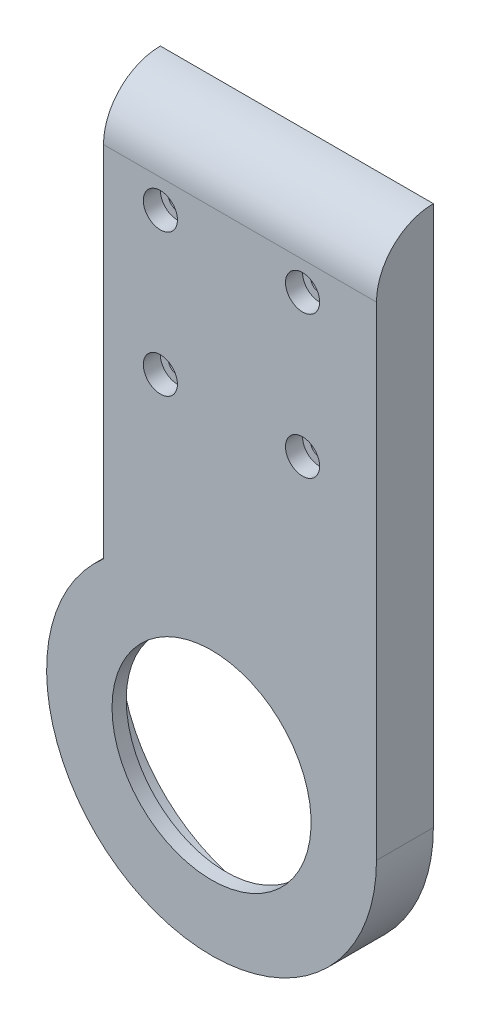
ISO-10303-21;
HEADER;
FILE_DESCRIPTION(('STEP AP214'),'2;1');
FILE_NAME('part.step','',(''),(''),'','','');
FILE_SCHEMA(('AUTOMOTIVE_DESIGN { 1 0 10303 214 1 1 1 1 }'));
ENDSEC;
DATA;
#1=APPLICATION_CONTEXT('core data for automotive mechanical design processes');
#2=APPLICATION_PROTOCOL_DEFINITION('international standard','automotive_design',2000,#1);
#3=PRODUCT_CONTEXT('',#1,'mechanical');
#4=PRODUCT('Part','Part','',(#3));
#5=PRODUCT_RELATED_PRODUCT_CATEGORY('part','',(#4));
#6=PRODUCT_DEFINITION_FORMATION('','',#4);
#7=PRODUCT_DEFINITION_CONTEXT('part definition',#1,'design');
#8=PRODUCT_DEFINITION('design','',#6,#7);
#9=PRODUCT_DEFINITION_SHAPE('','',#8);
#10=(LENGTH_UNIT() NAMED_UNIT(*) SI_UNIT(.MILLI.,.METRE.));
#11=(NAMED_UNIT(*) PLANE_ANGLE_UNIT() SI_UNIT($,.RADIAN.));
#12=(NAMED_UNIT(*) SI_UNIT($,.STERADIAN.) SOLID_ANGLE_UNIT());
#13=UNCERTAINTY_MEASURE_WITH_UNIT(LENGTH_MEASURE(1.E-05),#10,'distance_accuracy_value','');
#14=(GEOMETRIC_REPRESENTATION_CONTEXT(3) GLOBAL_UNCERTAINTY_ASSIGNED_CONTEXT((#13)) GLOBAL_UNIT_ASSIGNED_CONTEXT((#10,
#11,#12)) REPRESENTATION_CONTEXT('',''));
#15=CARTESIAN_POINT('',(0.,0.,0.));
#16=DIRECTION('',(0.,0.,1.));
#17=DIRECTION('',(1.,0.,0.));
#18=AXIS2_PLACEMENT_3D('',#15,#16,#17);
#19=CARTESIAN_POINT('',(-9.,80.,0.));
#20=DIRECTION('',(0.,0.,1.));
#21=DIRECTION('',(1.,0.,0.));
#22=AXIS2_PLACEMENT_3D('',#19,#20,#21);
#23=CYLINDRICAL_SURFACE('',#22,1.60000000000001);
#24=CARTESIAN_POINT('',(-9.,80.,0.));
#25=DIRECTION('',(0.,0.,1.));
#26=DIRECTION('',(1.,0.,0.));
#27=AXIS2_PLACEMENT_3D('',#24,#25,#26);
#28=CIRCLE('',#27,1.60000000000001);
#29=CARTESIAN_POINT('',(-7.39999999999999,80.,0.));
#30=VERTEX_POINT('',#29);
#31=EDGE_CURVE('E142',#30,#30,#28,.T.);
#32=ORIENTED_EDGE('',*,*,#31,.F.);
#33=EDGE_LOOP('',(#32));
#34=FACE_BOUND('',#33,.T.);
#35=CARTESIAN_POINT('',(-9.,80.,7.));
#36=DIRECTION('',(0.,0.,1.));
#37=DIRECTION('',(1.,0.,0.));
#38=AXIS2_PLACEMENT_3D('',#35,#36,#37);
#39=CIRCLE('',#38,1.60000000000001);
#40=CARTESIAN_POINT('',(-7.39999999999999,80.,7.));
#41=VERTEX_POINT('',#40);
#42=EDGE_CURVE('E45',#41,#41,#39,.F.);
#43=ORIENTED_EDGE('',*,*,#42,.F.);
#44=EDGE_LOOP('',(#43));
#45=FACE_BOUND('',#44,.T.);
#46=ADVANCED_FACE('F41',(#34,#45),#23,.F.);
#47=CARTESIAN_POINT('',(16.,80.,0.));
#48=DIRECTION('',(0.,0.,1.));
#49=DIRECTION('',(1.,0.,0.));
#50=AXIS2_PLACEMENT_3D('',#47,#48,#49);
#51=CYLINDRICAL_SURFACE('',#50,1.60000000000001);
#52=CARTESIAN_POINT('',(16.,80.,0.));
#53=DIRECTION('',(0.,0.,1.));
#54=DIRECTION('',(1.,0.,0.));
#55=AXIS2_PLACEMENT_3D('',#52,#53,#54);
#56=CIRCLE('',#55,1.60000000000001);
#57=CARTESIAN_POINT('',(17.6,80.,0.));
#58=VERTEX_POINT('',#57);
#59=EDGE_CURVE('E138',#58,#58,#56,.T.);
#60=ORIENTED_EDGE('',*,*,#59,.F.);
#61=EDGE_LOOP('',(#60));
#62=FACE_BOUND('',#61,.T.);
#63=CARTESIAN_POINT('',(16.,80.,7.));
#64=DIRECTION('',(0.,0.,1.));
#65=DIRECTION('',(1.,0.,0.));
#66=AXIS2_PLACEMENT_3D('',#63,#64,#65);
#67=CIRCLE('',#66,1.60000000000001);
#68=CARTESIAN_POINT('',(17.6,80.,7.));
#69=VERTEX_POINT('',#68);
#70=EDGE_CURVE('E124',#69,#69,#67,.F.);
#71=ORIENTED_EDGE('',*,*,#70,.F.);
#72=EDGE_LOOP('',(#71));
#73=FACE_BOUND('',#72,.T.);
#74=ADVANCED_FACE('F184',(#62,#73),#51,.F.);
#75=CARTESIAN_POINT('',(16.0000000000013,55.,0.));
#76=DIRECTION('',(0.,0.,1.));
#77=DIRECTION('',(1.,0.,0.));
#78=AXIS2_PLACEMENT_3D('',#75,#76,#77);
#79=CYLINDRICAL_SURFACE('',#78,1.6);
#80=CARTESIAN_POINT('',(16.0000000000013,55.,0.));
#81=DIRECTION('',(0.,0.,1.));
#82=DIRECTION('',(1.,0.,0.));
#83=AXIS2_PLACEMENT_3D('',#80,#81,#82);
#84=CIRCLE('',#83,1.6);
#85=CARTESIAN_POINT('',(17.6000000000013,55.,0.));
#86=VERTEX_POINT('',#85);
#87=EDGE_CURVE('E133',#86,#86,#84,.T.);
#88=ORIENTED_EDGE('',*,*,#87,.F.);
#89=EDGE_LOOP('',(#88));
#90=FACE_BOUND('',#89,.T.);
#91=CARTESIAN_POINT('',(16.0000000000013,55.,7.));
#92=DIRECTION('',(0.,0.,1.));
#93=DIRECTION('',(1.,0.,0.));
#94=AXIS2_PLACEMENT_3D('',#91,#92,#93);
#95=CIRCLE('',#94,1.6);
#96=CARTESIAN_POINT('',(17.6000000000013,55.,7.));
#97=VERTEX_POINT('',#96);
#98=EDGE_CURVE('E121',#97,#97,#95,.F.);
#99=ORIENTED_EDGE('',*,*,#98,.F.);
#100=EDGE_LOOP('',(#99));
#101=FACE_BOUND('',#100,.T.);
#102=ADVANCED_FACE('F190',(#90,#101),#79,.F.);
#103=CARTESIAN_POINT('',(-8.99999999999867,55.,0.));
#104=DIRECTION('',(0.,0.,1.));
#105=DIRECTION('',(1.,0.,0.));
#106=AXIS2_PLACEMENT_3D('',#103,#104,#105);
#107=CYLINDRICAL_SURFACE('',#106,1.59999999999999);
#108=CARTESIAN_POINT('',(-8.99999999999867,55.,0.));
#109=DIRECTION('',(0.,0.,1.));
#110=DIRECTION('',(1.,0.,0.));
#111=AXIS2_PLACEMENT_3D('',#108,#109,#110);
#112=CIRCLE('',#111,1.59999999999999);
#113=CARTESIAN_POINT('',(-7.39999999999868,55.,0.));
#114=VERTEX_POINT('',#113);
#115=EDGE_CURVE('E129',#114,#114,#112,.T.);
#116=ORIENTED_EDGE('',*,*,#115,.F.);
#117=EDGE_LOOP('',(#116));
#118=FACE_BOUND('',#117,.T.);
#119=CARTESIAN_POINT('',(-8.99999999999867,55.,7.));
#120=DIRECTION('',(0.,0.,1.));
#121=DIRECTION('',(1.,0.,0.));
#122=AXIS2_PLACEMENT_3D('',#119,#120,#121);
#123=CIRCLE('',#122,1.59999999999999);
#124=CARTESIAN_POINT('',(-7.39999999999868,55.,7.));
#125=VERTEX_POINT('',#124);
#126=EDGE_CURVE('E118',#125,#125,#123,.F.);
#127=ORIENTED_EDGE('',*,*,#126,.F.);
#128=EDGE_LOOP('',(#127));
#129=FACE_BOUND('',#128,.T.);
#130=ADVANCED_FACE('F196',(#118,#129),#107,.F.);
#131=CARTESIAN_POINT('',(0.,0.,7.5));
#132=DIRECTION('',(0.,0.,-1.));
#133=DIRECTION('',(-1.,0.,0.));
#134=AXIS2_PLACEMENT_3D('',#131,#132,#133);
#135=PLANE('',#134);
#136=CARTESIAN_POINT('',(0.,0.,7.5));
#137=DIRECTION('',(0.,0.,-1.));
#138=DIRECTION('',(-1.,0.,0.));
#139=AXIS2_PLACEMENT_3D('',#136,#137,#138);
#140=CIRCLE('',#139,17.5);
#141=CARTESIAN_POINT('',(-17.5,0.,7.5));
#142=VERTEX_POINT('',#141);
#143=EDGE_CURVE('E152',#142,#142,#140,.T.);
#144=ORIENTED_EDGE('',*,*,#143,.F.);
#145=EDGE_LOOP('',(#144));
#146=FACE_BOUND('',#145,.T.);
#147=CARTESIAN_POINT('',(0.,0.,7.5));
#148=DIRECTION('',(0.,0.,-1.));
#149=DIRECTION('',(-1.,0.,0.));
#150=AXIS2_PLACEMENT_3D('',#147,#148,#149);
#151=CIRCLE('',#150,24.);
#152=CARTESIAN_POINT('',(-24.,0.,7.5));
#153=VERTEX_POINT('',#152);
#154=EDGE_CURVE('E108',#153,#153,#151,.F.);
#155=ORIENTED_EDGE('',*,*,#154,.F.);
#156=EDGE_LOOP('',(#155));
#157=FACE_BOUND('',#156,.T.);
#158=ADVANCED_FACE('F215',(#146,#157),#135,.T.);
#159=CARTESIAN_POINT('',(0.,0.,10.));
#160=DIRECTION('',(0.,0.,1.));
#161=DIRECTION('',(1.,0.,0.));
#162=AXIS2_PLACEMENT_3D('',#159,#160,#161);
#163=PLANE('',#162);
#164=CARTESIAN_POINT('',(-8.99999999999867,55.,10.));
#165=DIRECTION('',(0.,0.,1.));
#166=DIRECTION('',(1.,0.,0.));
#167=AXIS2_PLACEMENT_3D('',#164,#165,#166);
#168=CIRCLE('',#167,3.);
#169=CARTESIAN_POINT('',(-5.99999999999867,55.,10.));
#170=VERTEX_POINT('',#169);
#171=EDGE_CURVE('E250',#170,#170,#168,.T.);
#172=ORIENTED_EDGE('',*,*,#171,.F.);
#173=EDGE_LOOP('',(#172));
#174=FACE_BOUND('',#173,.T.);
#175=CARTESIAN_POINT('',(16.0000000000013,55.,10.));
#176=DIRECTION('',(0.,0.,1.));
#177=DIRECTION('',(1.,0.,0.));
#178=AXIS2_PLACEMENT_3D('',#175,#176,#177);
#179=CIRCLE('',#178,3.);
#180=CARTESIAN_POINT('',(19.0000000000013,55.,10.));
#181=VERTEX_POINT('',#180);
#182=EDGE_CURVE('E256',#181,#181,#179,.T.);
#183=ORIENTED_EDGE('',*,*,#182,.F.);
#184=EDGE_LOOP('',(#183));
#185=FACE_BOUND('',#184,.T.);
#186=CARTESIAN_POINT('',(16.,80.,10.));
#187=DIRECTION('',(0.,0.,1.));
#188=DIRECTION('',(1.,0.,0.));
#189=AXIS2_PLACEMENT_3D('',#186,#187,#188);
#190=CIRCLE('',#189,3.);
#191=CARTESIAN_POINT('',(19.,80.,10.));
#192=VERTEX_POINT('',#191);
#193=EDGE_CURVE('E244',#192,#192,#190,.T.);
#194=ORIENTED_EDGE('',*,*,#193,.F.);
#195=EDGE_LOOP('',(#194));
#196=FACE_BOUND('',#195,.T.);
#197=CARTESIAN_POINT('',(-9.,80.,10.));
#198=DIRECTION('',(0.,0.,1.));
#199=DIRECTION('',(1.,0.,0.));
#200=AXIS2_PLACEMENT_3D('',#197,#198,#199);
#201=CIRCLE('',#200,3.);
#202=CARTESIAN_POINT('',(-6.,80.,10.));
#203=VERTEX_POINT('',#202);
#204=EDGE_CURVE('E241',#203,#203,#201,.T.);
#205=ORIENTED_EDGE('',*,*,#204,.F.);
#206=EDGE_LOOP('',(#205));
#207=FACE_BOUND('',#206,.T.);
#208=CARTESIAN_POINT('',(0.,0.,10.));
#209=DIRECTION('',(0.,0.,-1.));
#210=DIRECTION('',(-1.,0.,0.));
#211=AXIS2_PLACEMENT_3D('',#208,#209,#210);
#212=CIRCLE('',#211,17.5);
#213=CARTESIAN_POINT('',(-17.5,0.,10.));
#214=VERTEX_POINT('',#213);
#215=EDGE_CURVE('E155',#214,#214,#212,.T.);
#216=ORIENTED_EDGE('',*,*,#215,.T.);
#217=EDGE_LOOP('',(#216));
#218=FACE_BOUND('',#217,.T.);
#219=DIRECTION('',(0.,-1.,0.));
#220=VECTOR('',#219,1.);
#221=CARTESIAN_POINT('',(29.,0.,10.));
#222=LINE('',#221,#220);
#223=CARTESIAN_POINT('',(29.,85.,10.));
#224=VERTEX_POINT('',#223);
#225=CARTESIAN_POINT('',(29.,0.,10.));
#226=VERTEX_POINT('',#225);
#227=EDGE_CURVE('E105',#224,#226,#222,.T.);
#228=ORIENTED_EDGE('',*,*,#227,.F.);
#229=DIRECTION('',(1.,0.,0.));
#230=VECTOR('',#229,1.);
#231=CARTESIAN_POINT('',(-19.,85.,10.));
#232=LINE('',#231,#230);
#233=CARTESIAN_POINT('',(-19.,85.,10.));
#234=VERTEX_POINT('',#233);
#235=EDGE_CURVE('E50',#224,#234,#232,.F.);
#236=ORIENTED_EDGE('',*,*,#235,.T.);
#237=DIRECTION('',(0.,1.,0.));
#238=VECTOR('',#237,1.);
#239=CARTESIAN_POINT('',(-19.,0.,10.));
#240=LINE('',#239,#238);
#241=CARTESIAN_POINT('',(-19.,21.9089023002066,10.));
#242=VERTEX_POINT('',#241);
#243=EDGE_CURVE('E102',#242,#234,#240,.T.);
#244=ORIENTED_EDGE('',*,*,#243,.F.);
#245=CARTESIAN_POINT('',(0.,0.,10.));
#246=DIRECTION('',(0.,0.,-1.));
#247=DIRECTION('',(-1.,0.,0.));
#248=AXIS2_PLACEMENT_3D('',#245,#246,#247);
#249=CIRCLE('',#248,29.);
#250=EDGE_CURVE('E94',#226,#242,#249,.T.);
#251=ORIENTED_EDGE('',*,*,#250,.F.);
#252=EDGE_LOOP('',(#228,#236,#244,#251));
#253=FACE_BOUND('',#252,.T.);
#254=ADVANCED_FACE('F225',(#174,#185,#196,#207,#218,#253),#163,.T.);
#255=CARTESIAN_POINT('',(0.,0.,0.));
#256=DIRECTION('',(0.,0.,1.));
#257=DIRECTION('',(1.,0.,0.));
#258=AXIS2_PLACEMENT_3D('',#255,#256,#257);
#259=PLANE('',#258);
#260=ORIENTED_EDGE('',*,*,#115,.T.);
#261=EDGE_LOOP('',(#260));
#262=FACE_BOUND('',#261,.T.);
#263=ORIENTED_EDGE('',*,*,#87,.T.);
#264=EDGE_LOOP('',(#263));
#265=FACE_BOUND('',#264,.T.);
#266=ORIENTED_EDGE('',*,*,#59,.T.);
#267=EDGE_LOOP('',(#266));
#268=FACE_BOUND('',#267,.T.);
#269=ORIENTED_EDGE('',*,*,#31,.T.);
#270=EDGE_LOOP('',(#269));
#271=FACE_BOUND('',#270,.T.);
#272=CARTESIAN_POINT('',(0.,0.,0.));
#273=DIRECTION('',(0.,0.,-1.));
#274=DIRECTION('',(-1.,0.,0.));
#275=AXIS2_PLACEMENT_3D('',#272,#273,#274);
#276=CIRCLE('',#275,26.1);
#277=CARTESIAN_POINT('',(-26.1,0.,0.));
#278=VERTEX_POINT('',#277);
#279=EDGE_CURVE('E158',#278,#278,#276,.T.);
#280=ORIENTED_EDGE('',*,*,#279,.F.);
#281=EDGE_LOOP('',(#280));
#282=FACE_BOUND('',#281,.T.);
#283=DIRECTION('',(0.,-1.,0.));
#284=VECTOR('',#283,1.);
#285=CARTESIAN_POINT('',(29.,0.,0.));
#286=LINE('',#285,#284);
#287=CARTESIAN_POINT('',(29.,95.,0.));
#288=VERTEX_POINT('',#287);
#289=CARTESIAN_POINT('',(29.,0.,0.));
#290=VERTEX_POINT('',#289);
#291=EDGE_CURVE('E98',#288,#290,#286,.T.);
#292=ORIENTED_EDGE('',*,*,#291,.T.);
#293=CARTESIAN_POINT('',(0.,0.,0.));
#294=DIRECTION('',(0.,0.,-1.));
#295=DIRECTION('',(-1.,0.,0.));
#296=AXIS2_PLACEMENT_3D('',#293,#294,#295);
#297=CIRCLE('',#296,29.);
#298=CARTESIAN_POINT('',(-19.,21.9089023002066,0.));
#299=VERTEX_POINT('',#298);
#300=EDGE_CURVE('E83',#290,#299,#297,.T.);
#301=ORIENTED_EDGE('',*,*,#300,.T.);
#302=DIRECTION('',(0.,1.,0.));
#303=VECTOR('',#302,1.);
#304=CARTESIAN_POINT('',(-19.,0.,0.));
#305=LINE('',#304,#303);
#306=CARTESIAN_POINT('',(-19.,95.,0.));
#307=VERTEX_POINT('',#306);
#308=EDGE_CURVE('E106',#299,#307,#305,.T.);
#309=ORIENTED_EDGE('',*,*,#308,.T.);
#310=DIRECTION('',(1.,0.,0.));
#311=VECTOR('',#310,1.);
#312=CARTESIAN_POINT('',(0.,95.,0.));
#313=LINE('',#312,#311);
#314=EDGE_CURVE('E101',#307,#288,#313,.T.);
#315=ORIENTED_EDGE('',*,*,#314,.T.);
#316=EDGE_LOOP('',(#292,#301,#309,#315));
#317=FACE_BOUND('',#316,.T.);
#318=ADVANCED_FACE('F99',(#262,#265,#268,#271,#282,#317),#259,.F.);
#319=CARTESIAN_POINT('',(29.,0.,0.));
#320=DIRECTION('',(-1.,0.,0.));
#321=DIRECTION('',(0.,-1.,0.));
#322=AXIS2_PLACEMENT_3D('',#319,#320,#321);
#323=PLANE('',#322);
#324=ORIENTED_EDGE('',*,*,#291,.F.);
#325=CARTESIAN_POINT('',(29.,85.,0.));
#326=DIRECTION('',(-1.,0.,0.));
#327=DIRECTION('',(0.,-1.,0.));
#328=AXIS2_PLACEMENT_3D('',#325,#326,#327);
#329=CIRCLE('',#328,10.);
#330=EDGE_CURVE('E65',#288,#224,#329,.F.);
#331=ORIENTED_EDGE('',*,*,#330,.T.);
#332=ORIENTED_EDGE('',*,*,#227,.T.);
#333=DIRECTION('',(0.,0.,1.));
#334=VECTOR('',#333,1.);
#335=CARTESIAN_POINT('',(29.,0.,0.));
#336=LINE('',#335,#334);
#337=EDGE_CURVE('E87',#290,#226,#336,.T.);
#338=ORIENTED_EDGE('',*,*,#337,.F.);
#339=EDGE_LOOP('',(#324,#331,#332,#338));
#340=FACE_BOUND('',#339,.T.);
#341=ADVANCED_FACE('F104',(#340),#323,.F.);
#342=CARTESIAN_POINT('',(-19.,0.,0.));
#343=DIRECTION('',(1.,0.,0.));
#344=DIRECTION('',(0.,0.,-1.));
#345=AXIS2_PLACEMENT_3D('',#342,#343,#344);
#346=PLANE('',#345);
#347=ORIENTED_EDGE('',*,*,#243,.T.);
#348=CARTESIAN_POINT('',(-19.,85.,0.));
#349=DIRECTION('',(1.,0.,0.));
#350=DIRECTION('',(0.,0.,-1.));
#351=AXIS2_PLACEMENT_3D('',#348,#349,#350);
#352=CIRCLE('',#351,10.);
#353=EDGE_CURVE('E11',#234,#307,#352,.F.);
#354=ORIENTED_EDGE('',*,*,#353,.T.);
#355=ORIENTED_EDGE('',*,*,#308,.F.);
#356=DIRECTION('',(0.,0.,-1.));
#357=VECTOR('',#356,1.);
#358=CARTESIAN_POINT('',(-19.,21.9089023002066,10.));
#359=LINE('',#358,#357);
#360=EDGE_CURVE('E90',#299,#242,#359,.F.);
#361=ORIENTED_EDGE('',*,*,#360,.T.);
#362=EDGE_LOOP('',(#347,#354,#355,#361));
#363=FACE_BOUND('',#362,.T.);
#364=ADVANCED_FACE('F168',(#363),#346,.F.);
#365=CARTESIAN_POINT('',(0.,0.,10.));
#366=DIRECTION('',(0.,0.,-1.));
#367=DIRECTION('',(-1.,0.,0.));
#368=AXIS2_PLACEMENT_3D('',#365,#366,#367);
#369=CYLINDRICAL_SURFACE('',#368,29.);
#370=ORIENTED_EDGE('',*,*,#337,.T.);
#371=ORIENTED_EDGE('',*,*,#250,.T.);
#372=ORIENTED_EDGE('',*,*,#360,.F.);
#373=ORIENTED_EDGE('',*,*,#300,.F.);
#374=EDGE_LOOP('',(#370,#371,#372,#373));
#375=FACE_BOUND('',#374,.T.);
#376=ADVANCED_FACE('F85',(#375),#369,.T.);
#377=CARTESIAN_POINT('',(0.,0.,7.5));
#378=DIRECTION('',(0.,0.,-1.));
#379=DIRECTION('',(-1.,0.,0.));
#380=AXIS2_PLACEMENT_3D('',#377,#378,#379);
#381=CYLINDRICAL_SURFACE('',#380,26.1);
#382=CARTESIAN_POINT('',(0.,0.,7.5));
#383=DIRECTION('',(0.,0.,-1.));
#384=DIRECTION('',(-1.,0.,0.));
#385=AXIS2_PLACEMENT_3D('',#382,#383,#384);
#386=CIRCLE('',#385,26.1);
#387=CARTESIAN_POINT('',(-26.1,0.,7.5));
#388=VERTEX_POINT('',#387);
#389=EDGE_CURVE('E95',#388,#388,#386,.T.);
#390=ORIENTED_EDGE('',*,*,#389,.F.);
#391=EDGE_LOOP('',(#390));
#392=FACE_BOUND('',#391,.T.);
#393=ORIENTED_EDGE('',*,*,#279,.T.);
#394=EDGE_LOOP('',(#393));
#395=FACE_BOUND('',#394,.T.);
#396=ADVANCED_FACE('F213',(#392,#395),#381,.F.);
#397=CARTESIAN_POINT('',(0.,0.,7.5));
#398=DIRECTION('',(0.,0.,-1.));
#399=DIRECTION('',(-1.,0.,0.));
#400=AXIS2_PLACEMENT_3D('',#397,#398,#399);
#401=CIRCLE('',#400,26.05);
#402=CARTESIAN_POINT('',(-26.05,0.,7.5));
#403=VERTEX_POINT('',#402);
#404=EDGE_CURVE('E148',#403,#403,#401,.T.);
#405=ORIENTED_EDGE('',*,*,#404,.F.);
#406=EDGE_LOOP('',(#405));
#407=FACE_BOUND('',#406,.T.);
#408=ORIENTED_EDGE('',*,*,#389,.T.);
#409=EDGE_LOOP('',(#408));
#410=FACE_BOUND('',#409,.T.);
#411=ADVANCED_FACE('F209',(#407,#410),#135,.T.);
#412=CARTESIAN_POINT('',(0.,0.,10.));
#413=DIRECTION('',(0.,0.,-1.));
#414=DIRECTION('',(-1.,0.,0.));
#415=AXIS2_PLACEMENT_3D('',#412,#413,#414);
#416=CYLINDRICAL_SURFACE('',#415,17.5);
#417=ORIENTED_EDGE('',*,*,#215,.F.);
#418=EDGE_LOOP('',(#417));
#419=FACE_BOUND('',#418,.T.);
#420=ORIENTED_EDGE('',*,*,#143,.T.);
#421=EDGE_LOOP('',(#420));
#422=FACE_BOUND('',#421,.T.);
#423=ADVANCED_FACE('F202',(#419,#422),#416,.F.);
#424=CARTESIAN_POINT('',(0.,0.,6.));
#425=DIRECTION('',(0.,0.,-1.));
#426=DIRECTION('',(-1.,0.,0.));
#427=AXIS2_PLACEMENT_3D('',#424,#425,#426);
#428=PLANE('',#427);
#429=CARTESIAN_POINT('',(0.,0.,6.));
#430=DIRECTION('',(0.,0.,-1.));
#431=DIRECTION('',(-1.,0.,0.));
#432=AXIS2_PLACEMENT_3D('',#429,#430,#431);
#433=CIRCLE('',#432,26.05);
#434=CARTESIAN_POINT('',(-26.05,0.,6.));
#435=VERTEX_POINT('',#434);
#436=EDGE_CURVE('E149',#435,#435,#433,.T.);
#437=ORIENTED_EDGE('',*,*,#436,.T.);
#438=EDGE_LOOP('',(#437));
#439=FACE_BOUND('',#438,.T.);
#440=CARTESIAN_POINT('',(0.,0.,6.));
#441=DIRECTION('',(0.,0.,-1.));
#442=DIRECTION('',(-1.,0.,0.));
#443=AXIS2_PLACEMENT_3D('',#440,#441,#442);
#444=CIRCLE('',#443,24.);
#445=CARTESIAN_POINT('',(-24.,0.,6.));
#446=VERTEX_POINT('',#445);
#447=EDGE_CURVE('E145',#446,#446,#444,.T.);
#448=ORIENTED_EDGE('',*,*,#447,.F.);
#449=EDGE_LOOP('',(#448));
#450=FACE_BOUND('',#449,.T.);
#451=ADVANCED_FACE('F199',(#439,#450),#428,.T.);
#452=CARTESIAN_POINT('',(0.,0.,6.));
#453=DIRECTION('',(0.,0.,1.));
#454=DIRECTION('',(1.,0.,0.));
#455=AXIS2_PLACEMENT_3D('',#452,#453,#454);
#456=CYLINDRICAL_SURFACE('',#455,26.05);
#457=ORIENTED_EDGE('',*,*,#436,.F.);
#458=EDGE_LOOP('',(#457));
#459=FACE_BOUND('',#458,.T.);
#460=ORIENTED_EDGE('',*,*,#404,.T.);
#461=EDGE_LOOP('',(#460));
#462=FACE_BOUND('',#461,.T.);
#463=ADVANCED_FACE('F180',(#459,#462),#456,.T.);
#464=CARTESIAN_POINT('',(0.,0.,6.));
#465=DIRECTION('',(0.,0.,1.));
#466=DIRECTION('',(1.,0.,0.));
#467=AXIS2_PLACEMENT_3D('',#464,#465,#466);
#468=CYLINDRICAL_SURFACE('',#467,24.);
#469=ORIENTED_EDGE('',*,*,#447,.T.);
#470=EDGE_LOOP('',(#469));
#471=FACE_BOUND('',#470,.T.);
#472=ORIENTED_EDGE('',*,*,#154,.T.);
#473=EDGE_LOOP('',(#472));
#474=FACE_BOUND('',#473,.T.);
#475=ADVANCED_FACE('F172',(#471,#474),#468,.F.);
#476=CARTESIAN_POINT('',(0.,85.,0.));
#477=DIRECTION('',(-1.,0.,0.));
#478=DIRECTION('',(0.,0.,1.));
#479=AXIS2_PLACEMENT_3D('',#476,#477,#478);
#480=CYLINDRICAL_SURFACE('',#479,10.);
#481=ORIENTED_EDGE('',*,*,#353,.F.);
#482=ORIENTED_EDGE('',*,*,#235,.F.);
#483=ORIENTED_EDGE('',*,*,#330,.F.);
#484=ORIENTED_EDGE('',*,*,#314,.F.);
#485=EDGE_LOOP('',(#481,#482,#483,#484));
#486=FACE_BOUND('',#485,.T.);
#487=ADVANCED_FACE('F43',(#486),#480,.T.);
#488=CARTESIAN_POINT('',(-8.99999999999867,55.,7.));
#489=DIRECTION('',(0.,0.,1.));
#490=DIRECTION('',(1.,0.,0.));
#491=AXIS2_PLACEMENT_3D('',#488,#489,#490);
#492=PLANE('',#491);
#493=CARTESIAN_POINT('',(-8.99999999999867,55.,7.));
#494=DIRECTION('',(0.,0.,1.));
#495=DIRECTION('',(1.,0.,0.));
#496=AXIS2_PLACEMENT_3D('',#493,#494,#495);
#497=CIRCLE('',#496,3.);
#498=CARTESIAN_POINT('',(-5.99999999999867,55.,7.));
#499=VERTEX_POINT('',#498);
#500=EDGE_CURVE('E247',#499,#499,#497,.T.);
#501=ORIENTED_EDGE('',*,*,#500,.T.);
#502=EDGE_LOOP('',(#501));
#503=FACE_BOUND('',#502,.T.);
#504=ORIENTED_EDGE('',*,*,#126,.T.);
#505=EDGE_LOOP('',(#504));
#506=FACE_BOUND('',#505,.T.);
#507=ADVANCED_FACE('F171',(#503,#506),#492,.T.);
#508=CARTESIAN_POINT('',(-8.99999999999867,55.,7.));
#509=DIRECTION('',(0.,0.,1.));
#510=DIRECTION('',(1.,0.,0.));
#511=AXIS2_PLACEMENT_3D('',#508,#509,#510);
#512=CYLINDRICAL_SURFACE('',#511,3.);
#513=ORIENTED_EDGE('',*,*,#500,.F.);
#514=EDGE_LOOP('',(#513));
#515=FACE_BOUND('',#514,.T.);
#516=ORIENTED_EDGE('',*,*,#171,.T.);
#517=EDGE_LOOP('',(#516));
#518=FACE_BOUND('',#517,.T.);
#519=ADVANCED_FACE('F177',(#515,#518),#512,.F.);
#520=CARTESIAN_POINT('',(16.0000000000013,55.,7.));
#521=DIRECTION('',(0.,0.,1.));
#522=DIRECTION('',(1.,0.,0.));
#523=AXIS2_PLACEMENT_3D('',#520,#521,#522);
#524=PLANE('',#523);
#525=CARTESIAN_POINT('',(16.0000000000013,55.,7.));
#526=DIRECTION('',(0.,0.,1.));
#527=DIRECTION('',(1.,0.,0.));
#528=AXIS2_PLACEMENT_3D('',#525,#526,#527);
#529=CIRCLE('',#528,3.);
#530=CARTESIAN_POINT('',(19.0000000000013,55.,7.));
#531=VERTEX_POINT('',#530);
#532=EDGE_CURVE('E253',#531,#531,#529,.T.);
#533=ORIENTED_EDGE('',*,*,#532,.T.);
#534=EDGE_LOOP('',(#533));
#535=FACE_BOUND('',#534,.T.);
#536=ORIENTED_EDGE('',*,*,#98,.T.);
#537=EDGE_LOOP('',(#536));
#538=FACE_BOUND('',#537,.T.);
#539=ADVANCED_FACE('F303',(#535,#538),#524,.T.);
#540=CARTESIAN_POINT('',(16.0000000000013,55.,7.));
#541=DIRECTION('',(0.,0.,1.));
#542=DIRECTION('',(1.,0.,0.));
#543=AXIS2_PLACEMENT_3D('',#540,#541,#542);
#544=CYLINDRICAL_SURFACE('',#543,3.);
#545=ORIENTED_EDGE('',*,*,#532,.F.);
#546=EDGE_LOOP('',(#545));
#547=FACE_BOUND('',#546,.T.);
#548=ORIENTED_EDGE('',*,*,#182,.T.);
#549=EDGE_LOOP('',(#548));
#550=FACE_BOUND('',#549,.T.);
#551=ADVANCED_FACE('F307',(#547,#550),#544,.F.);
#552=CARTESIAN_POINT('',(16.,80.,7.));
#553=DIRECTION('',(0.,0.,1.));
#554=DIRECTION('',(1.,0.,0.));
#555=AXIS2_PLACEMENT_3D('',#552,#553,#554);
#556=PLANE('',#555);
#557=CARTESIAN_POINT('',(16.,80.,7.));
#558=DIRECTION('',(0.,0.,1.));
#559=DIRECTION('',(1.,0.,0.));
#560=AXIS2_PLACEMENT_3D('',#557,#558,#559);
#561=CIRCLE('',#560,3.);
#562=CARTESIAN_POINT('',(19.,80.,7.));
#563=VERTEX_POINT('',#562);
#564=EDGE_CURVE('E259',#563,#563,#561,.T.);
#565=ORIENTED_EDGE('',*,*,#564,.T.);
#566=EDGE_LOOP('',(#565));
#567=FACE_BOUND('',#566,.T.);
#568=ORIENTED_EDGE('',*,*,#70,.T.);
#569=EDGE_LOOP('',(#568));
#570=FACE_BOUND('',#569,.T.);
#571=ADVANCED_FACE('F311',(#567,#570),#556,.T.);
#572=CARTESIAN_POINT('',(16.,80.,7.));
#573=DIRECTION('',(0.,0.,1.));
#574=DIRECTION('',(1.,0.,0.));
#575=AXIS2_PLACEMENT_3D('',#572,#573,#574);
#576=CYLINDRICAL_SURFACE('',#575,3.);
#577=ORIENTED_EDGE('',*,*,#564,.F.);
#578=EDGE_LOOP('',(#577));
#579=FACE_BOUND('',#578,.T.);
#580=ORIENTED_EDGE('',*,*,#193,.T.);
#581=EDGE_LOOP('',(#580));
#582=FACE_BOUND('',#581,.T.);
#583=ADVANCED_FACE('F265',(#579,#582),#576,.F.);
#584=CARTESIAN_POINT('',(-9.,80.,7.));
#585=DIRECTION('',(0.,0.,1.));
#586=DIRECTION('',(1.,0.,0.));
#587=AXIS2_PLACEMENT_3D('',#584,#585,#586);
#588=PLANE('',#587);
#589=CARTESIAN_POINT('',(-9.,80.,7.));
#590=DIRECTION('',(0.,0.,1.));
#591=DIRECTION('',(1.,0.,0.));
#592=AXIS2_PLACEMENT_3D('',#589,#590,#591);
#593=CIRCLE('',#592,3.);
#594=CARTESIAN_POINT('',(-6.,80.,7.));
#595=VERTEX_POINT('',#594);
#596=EDGE_CURVE('E122',#595,#595,#593,.T.);
#597=ORIENTED_EDGE('',*,*,#596,.T.);
#598=EDGE_LOOP('',(#597));
#599=FACE_BOUND('',#598,.T.);
#600=ORIENTED_EDGE('',*,*,#42,.T.);
#601=EDGE_LOOP('',(#600));
#602=FACE_BOUND('',#601,.T.);
#603=ADVANCED_FACE('F296',(#599,#602),#588,.T.);
#604=CARTESIAN_POINT('',(-9.,80.,7.));
#605=DIRECTION('',(0.,0.,1.));
#606=DIRECTION('',(1.,0.,0.));
#607=AXIS2_PLACEMENT_3D('',#604,#605,#606);
#608=CYLINDRICAL_SURFACE('',#607,3.);
#609=ORIENTED_EDGE('',*,*,#596,.F.);
#610=EDGE_LOOP('',(#609));
#611=FACE_BOUND('',#610,.T.);
#612=ORIENTED_EDGE('',*,*,#204,.T.);
#613=EDGE_LOOP('',(#612));
#614=FACE_BOUND('',#613,.T.);
#615=ADVANCED_FACE('F293',(#611,#614),#608,.F.);
#616=CLOSED_SHELL('',(#46,#74,#102,#130,#158,#254,#318,#341,#364,#376,#396,#411,#423,#451,#463,
#475,#487,#507,#519,#539,#551,#571,#583,#603,#615));
#617=MANIFOLD_SOLID_BREP('B2',#616);
#618=ADVANCED_BREP_SHAPE_REPRESENTATION('',(#18,#617),#14);
#619=SHAPE_DEFINITION_REPRESENTATION(#9,#618);
ENDSEC;
END-ISO-10303-21;
